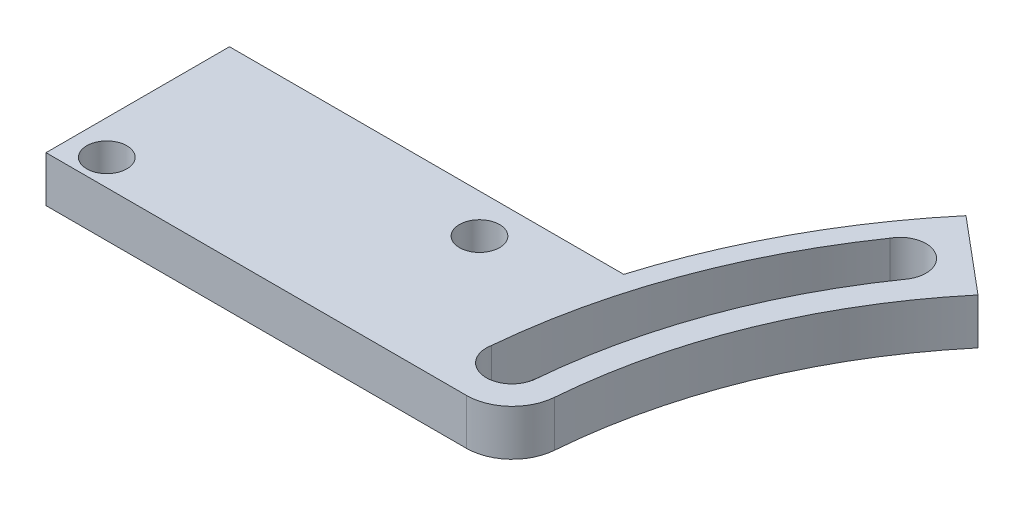
ISO-10303-21;
HEADER;
FILE_DESCRIPTION(('STEP AP214'),'2;1');
FILE_NAME('part.step','',(''),(''),'','','');
FILE_SCHEMA(('AUTOMOTIVE_DESIGN { 1 0 10303 214 1 1 1 1 }'));
ENDSEC;
DATA;
#1=APPLICATION_CONTEXT('core data for automotive mechanical design processes');
#2=APPLICATION_PROTOCOL_DEFINITION('international standard','automotive_design',2000,#1);
#3=PRODUCT_CONTEXT('',#1,'mechanical');
#4=PRODUCT('Part','Part','',(#3));
#5=PRODUCT_RELATED_PRODUCT_CATEGORY('part','',(#4));
#6=PRODUCT_DEFINITION_FORMATION('','',#4);
#7=PRODUCT_DEFINITION_CONTEXT('part definition',#1,'design');
#8=PRODUCT_DEFINITION('design','',#6,#7);
#9=PRODUCT_DEFINITION_SHAPE('','',#8);
#10=(LENGTH_UNIT() NAMED_UNIT(*) SI_UNIT(.MILLI.,.METRE.));
#11=(NAMED_UNIT(*) PLANE_ANGLE_UNIT() SI_UNIT($,.RADIAN.));
#12=(NAMED_UNIT(*) SI_UNIT($,.STERADIAN.) SOLID_ANGLE_UNIT());
#13=UNCERTAINTY_MEASURE_WITH_UNIT(LENGTH_MEASURE(1.E-05),#10,'distance_accuracy_value','');
#14=(GEOMETRIC_REPRESENTATION_CONTEXT(3) GLOBAL_UNCERTAINTY_ASSIGNED_CONTEXT((#13)) GLOBAL_UNIT_ASSIGNED_CONTEXT((#10,
#11,#12)) REPRESENTATION_CONTEXT('',''));
#15=CARTESIAN_POINT('',(0.,0.,0.));
#16=DIRECTION('',(0.,0.,1.));
#17=DIRECTION('',(1.,0.,0.));
#18=AXIS2_PLACEMENT_3D('',#15,#16,#17);
#19=CARTESIAN_POINT('',(0.,4.,0.));
#20=DIRECTION('',(0.,-1.,0.));
#21=DIRECTION('',(0.,0.,-1.));
#22=AXIS2_PLACEMENT_3D('',#19,#20,#21);
#23=CYLINDRICAL_SURFACE('',#22,55.);
#24=DIRECTION('',(0.,-1.,0.));
#25=VECTOR('',#24,1.);
#26=CARTESIAN_POINT('',(-42.132444371544,4.,-35.3533185327594));
#27=LINE('',#26,#25);
#28=CARTESIAN_POINT('',(-42.132444371544,0.,-35.3533185327594));
#29=VERTEX_POINT('',#28);
#30=CARTESIAN_POINT('',(-42.132444371544,4.,-35.3533185327594));
#31=VERTEX_POINT('',#30);
#32=EDGE_CURVE('E180',#29,#31,#27,.F.);
#33=ORIENTED_EDGE('',*,*,#32,.F.);
#34=CARTESIAN_POINT('',(0.,0.,0.));
#35=DIRECTION('',(0.,1.,0.));
#36=DIRECTION('',(0.,0.,1.));
#37=AXIS2_PLACEMENT_3D('',#34,#35,#36);
#38=CIRCLE('',#37,55.);
#39=CARTESIAN_POINT('',(-52.6212884676915,0.,-16.));
#40=VERTEX_POINT('',#39);
#41=EDGE_CURVE('E221',#29,#40,#38,.T.);
#42=ORIENTED_EDGE('',*,*,#41,.T.);
#43=DIRECTION('',(0.,-1.,0.));
#44=VECTOR('',#43,1.);
#45=CARTESIAN_POINT('',(-52.6212884676915,4.,-16.));
#46=LINE('',#45,#44);
#47=CARTESIAN_POINT('',(-52.6212884676915,4.,-16.));
#48=VERTEX_POINT('',#47);
#49=EDGE_CURVE('E218',#48,#40,#46,.T.);
#50=ORIENTED_EDGE('',*,*,#49,.F.);
#51=CARTESIAN_POINT('',(0.,4.,0.));
#52=DIRECTION('',(0.,1.,0.));
#53=DIRECTION('',(0.,0.,1.));
#54=AXIS2_PLACEMENT_3D('',#51,#52,#53);
#55=CIRCLE('',#54,55.);
#56=EDGE_CURVE('E222',#31,#48,#55,.T.);
#57=ORIENTED_EDGE('',*,*,#56,.F.);
#58=EDGE_LOOP('',(#33,#42,#50,#57));
#59=FACE_BOUND('',#58,.T.);
#60=ADVANCED_FACE('F33',(#59),#23,.T.);
#61=CARTESIAN_POINT('',(0.,4.,0.));
#62=DIRECTION('',(0.,-1.,0.));
#63=DIRECTION('',(0.,0.,-1.));
#64=AXIS2_PLACEMENT_3D('',#61,#62,#63);
#65=CYLINDRICAL_SURFACE('',#64,46.5);
#66=CARTESIAN_POINT('',(0.,4.,0.));
#67=DIRECTION('',(0.,1.,0.));
#68=DIRECTION('',(0.,0.,1.));
#69=AXIS2_PLACEMENT_3D('',#66,#67,#68);
#70=CIRCLE('',#69,46.5);
#71=CARTESIAN_POINT('',(-35.6210666050327,4.,-29.8896238504239));
#72=VERTEX_POINT('',#71);
#73=CARTESIAN_POINT('',(-46.3539024371184,4.,-3.68316831683168));
#74=VERTEX_POINT('',#73);
#75=EDGE_CURVE('E193',#72,#74,#70,.T.);
#76=ORIENTED_EDGE('',*,*,#75,.T.);
#77=DIRECTION('',(0.,-1.,0.));
#78=VECTOR('',#77,1.);
#79=CARTESIAN_POINT('',(-46.3539024371184,4.,-3.68316831683168));
#80=LINE('',#79,#78);
#81=CARTESIAN_POINT('',(-46.3539024371184,0.,-3.68316831683168));
#82=VERTEX_POINT('',#81);
#83=EDGE_CURVE('E228',#74,#82,#80,.T.);
#84=ORIENTED_EDGE('',*,*,#83,.T.);
#85=CARTESIAN_POINT('',(0.,0.,0.));
#86=DIRECTION('',(0.,1.,0.));
#87=DIRECTION('',(0.,0.,1.));
#88=AXIS2_PLACEMENT_3D('',#85,#86,#87);
#89=CIRCLE('',#88,46.5);
#90=CARTESIAN_POINT('',(-35.6210666050327,0.,-29.8896238504239));
#91=VERTEX_POINT('',#90);
#92=EDGE_CURVE('E191',#91,#82,#89,.T.);
#93=ORIENTED_EDGE('',*,*,#92,.F.);
#94=DIRECTION('',(0.,-1.,0.));
#95=VECTOR('',#94,1.);
#96=CARTESIAN_POINT('',(-35.6210666050327,4.,-29.8896238504239));
#97=LINE('',#96,#95);
#98=EDGE_CURVE('E224',#91,#72,#97,.F.);
#99=ORIENTED_EDGE('',*,*,#98,.T.);
#100=EDGE_LOOP('',(#76,#84,#93,#99));
#101=FACE_BOUND('',#100,.T.);
#102=ADVANCED_FACE('F261',(#101),#65,.F.);
#103=CARTESIAN_POINT('',(0.,4.,0.));
#104=DIRECTION('',(0.,1.,0.));
#105=DIRECTION('',(0.,0.,1.));
#106=AXIS2_PLACEMENT_3D('',#103,#104,#105);
#107=PLANE('',#106);
#108=CARTESIAN_POINT('',(0.,4.,0.));
#109=DIRECTION('',(0.,1.,0.));
#110=DIRECTION('',(0.,0.,1.));
#111=AXIS2_PLACEMENT_3D('',#108,#109,#110);
#112=CIRCLE('',#111,53.2380313408694);
#113=CARTESIAN_POINT('',(-53.0142817515423,4.,-4.87584981510754));
#114=VERTEX_POINT('',#113);
#115=CARTESIAN_POINT('',(-43.7454317895567,4.,-30.3418057899762));
#116=VERTEX_POINT('',#115);
#117=EDGE_CURVE('E151',#114,#116,#112,.F.);
#118=ORIENTED_EDGE('',*,*,#117,.T.);
#119=CARTESIAN_POINT('',(-41.776754258739,4.,-29.2523982539028));
#120=DIRECTION('',(0.,1.,0.));
#121=DIRECTION('',(-0.499999999999989,0.,0.866025403784445));
#122=AXIS2_PLACEMENT_3D('',#119,#120,#121);
#123=CIRCLE('',#122,2.25);
#124=CARTESIAN_POINT('',(-39.9711449872945,4.,-27.9099098335156));
#125=VERTEX_POINT('',#124);
#126=EDGE_CURVE('E150',#125,#116,#123,.T.);
#127=ORIENTED_EDGE('',*,*,#126,.F.);
#128=DIRECTION('',(0.819904880909852,0.,0.572499769659518));
#129=VECTOR('',#128,1.);
#130=CARTESIAN_POINT('',(0.,4.,0.));
#131=LINE('',#130,#129);
#132=CARTESIAN_POINT('',(-39.9703629443553,4.,-27.9093637709015));
#133=VERTEX_POINT('',#132);
#134=EDGE_CURVE('E56',#125,#133,#131,.T.);
#135=ORIENTED_EDGE('',*,*,#134,.T.);
#136=CARTESIAN_POINT('',(0.,4.,0.));
#137=DIRECTION('',(0.,1.,0.));
#138=DIRECTION('',(0.,0.,1.));
#139=AXIS2_PLACEMENT_3D('',#136,#137,#138);
#140=CIRCLE('',#139,48.75);
#141=CARTESIAN_POINT('',(-48.5829094993656,4.,-4.0327911644982));
#142=VERTEX_POINT('',#141);
#143=EDGE_CURVE('E137',#133,#142,#140,.T.);
#144=ORIENTED_EDGE('',*,*,#143,.T.);
#145=DIRECTION('',(0.996572502551089,0.,0.08272392132304));
#146=VECTOR('',#145,1.);
#147=CARTESIAN_POINT('',(0.,4.,0.));
#148=LINE('',#147,#146);
#149=CARTESIAN_POINT('',(-48.5938316215539,4.,-4.03369779274078));
#150=VERTEX_POINT('',#149);
#151=EDGE_CURVE('E153',#150,#142,#148,.T.);
#152=ORIENTED_EDGE('',*,*,#151,.F.);
#153=CARTESIAN_POINT('',(-50.805929602679,4.,-4.44494288013057));
#154=DIRECTION('',(0.,1.,0.));
#155=DIRECTION('',(0.,0.,1.));
#156=AXIS2_PLACEMENT_3D('',#153,#154,#155);
#157=CIRCLE('',#156,2.25);
#158=EDGE_CURVE('E189',#114,#150,#157,.T.);
#159=ORIENTED_EDGE('',*,*,#158,.F.);
#160=EDGE_LOOP('',(#118,#127,#135,#144,#152,#159));
#161=FACE_BOUND('',#160,.T.);
#162=CARTESIAN_POINT('',(-84.,4.,-2.3));
#163=DIRECTION('',(0.,1.,0.));
#164=DIRECTION('',(0.,0.,1.));
#165=AXIS2_PLACEMENT_3D('',#162,#163,#164);
#166=CIRCLE('',#165,1.75);
#167=CARTESIAN_POINT('',(-84.,4.,-0.550000000000003));
#168=VERTEX_POINT('',#167);
#169=EDGE_CURVE('E166',#168,#168,#166,.T.);
#170=ORIENTED_EDGE('',*,*,#169,.F.);
#171=EDGE_LOOP('',(#170));
#172=FACE_BOUND('',#171,.T.);
#173=CARTESIAN_POINT('',(-61.8,4.,-12.6));
#174=DIRECTION('',(0.,1.,0.));
#175=DIRECTION('',(0.,0.,1.));
#176=AXIS2_PLACEMENT_3D('',#173,#174,#175);
#177=CIRCLE('',#176,1.75);
#178=CARTESIAN_POINT('',(-61.8,4.,-10.85));
#179=VERTEX_POINT('',#178);
#180=EDGE_CURVE('E165',#179,#179,#177,.T.);
#181=ORIENTED_EDGE('',*,*,#180,.F.);
#182=EDGE_LOOP('',(#181));
#183=FACE_BOUND('',#182,.T.);
#184=DIRECTION('',(1.,0.,0.));
#185=VECTOR('',#184,1.);
#186=CARTESIAN_POINT('',(-87.,4.,0.));
#187=LINE('',#186,#185);
#188=CARTESIAN_POINT('',(-87.,4.,0.));
#189=VERTEX_POINT('',#188);
#190=CARTESIAN_POINT('',(-50.3413349048275,4.,0.));
#191=VERTEX_POINT('',#190);
#192=EDGE_CURVE('E204',#189,#191,#187,.T.);
#193=ORIENTED_EDGE('',*,*,#192,.T.);
#194=CARTESIAN_POINT('',(-50.3413349048275,4.,-4.));
#195=DIRECTION('',(0.,1.,0.));
#196=DIRECTION('',(0.,0.,1.));
#197=AXIS2_PLACEMENT_3D('',#194,#195,#196);
#198=CIRCLE('',#197,4.);
#199=EDGE_CURVE('E235',#191,#74,#198,.T.);
#200=ORIENTED_EDGE('',*,*,#199,.T.);
#201=ORIENTED_EDGE('',*,*,#75,.F.);
#202=DIRECTION('',(0.766044443118982,0.,0.642787609686535));
#203=VECTOR('',#202,1.);
#204=CARTESIAN_POINT('',(-47.8029153473241,4.,-40.1114086371379));
#205=LINE('',#204,#203);
#206=EDGE_CURVE('E178',#31,#72,#205,.T.);
#207=ORIENTED_EDGE('',*,*,#206,.F.);
#208=ORIENTED_EDGE('',*,*,#56,.T.);
#209=DIRECTION('',(-1.,0.,0.));
#210=VECTOR('',#209,1.);
#211=CARTESIAN_POINT('',(-87.,4.,-16.));
#212=LINE('',#211,#210);
#213=CARTESIAN_POINT('',(-87.,4.,-16.));
#214=VERTEX_POINT('',#213);
#215=EDGE_CURVE('E199',#48,#214,#212,.T.);
#216=ORIENTED_EDGE('',*,*,#215,.T.);
#217=DIRECTION('',(0.,0.,1.));
#218=VECTOR('',#217,1.);
#219=CARTESIAN_POINT('',(-87.,4.,0.));
#220=LINE('',#219,#218);
#221=EDGE_CURVE('E201',#214,#189,#220,.T.);
#222=ORIENTED_EDGE('',*,*,#221,.T.);
#223=EDGE_LOOP('',(#193,#200,#201,#207,#208,#216,#222));
#224=FACE_BOUND('',#223,.T.);
#225=ADVANCED_FACE('F147',(#161,#172,#183,#224),#107,.T.);
#226=CARTESIAN_POINT('',(0.,0.,0.));
#227=DIRECTION('',(0.,1.,0.));
#228=DIRECTION('',(0.,0.,1.));
#229=AXIS2_PLACEMENT_3D('',#226,#227,#228);
#230=PLANE('',#229);
#231=CARTESIAN_POINT('',(-84.,0.,-2.3));
#232=DIRECTION('',(0.,1.,0.));
#233=DIRECTION('',(0.,0.,1.));
#234=AXIS2_PLACEMENT_3D('',#231,#232,#233);
#235=CIRCLE('',#234,1.75);
#236=CARTESIAN_POINT('',(-84.,0.,-0.550000000000003));
#237=VERTEX_POINT('',#236);
#238=EDGE_CURVE('E170',#237,#237,#235,.T.);
#239=ORIENTED_EDGE('',*,*,#238,.T.);
#240=EDGE_LOOP('',(#239));
#241=FACE_BOUND('',#240,.T.);
#242=CARTESIAN_POINT('',(-61.8,0.,-12.6));
#243=DIRECTION('',(0.,1.,0.));
#244=DIRECTION('',(0.,0.,1.));
#245=AXIS2_PLACEMENT_3D('',#242,#243,#244);
#246=CIRCLE('',#245,1.75);
#247=CARTESIAN_POINT('',(-61.8,0.,-10.85));
#248=VERTEX_POINT('',#247);
#249=EDGE_CURVE('E173',#248,#248,#246,.T.);
#250=ORIENTED_EDGE('',*,*,#249,.T.);
#251=EDGE_LOOP('',(#250));
#252=FACE_BOUND('',#251,.T.);
#253=ORIENTED_EDGE('',*,*,#92,.T.);
#254=CARTESIAN_POINT('',(-50.3413349048275,0.,-4.));
#255=DIRECTION('',(0.,1.,0.));
#256=DIRECTION('',(0.,0.,1.));
#257=AXIS2_PLACEMENT_3D('',#254,#255,#256);
#258=CIRCLE('',#257,4.);
#259=CARTESIAN_POINT('',(-50.3413349048275,0.,0.));
#260=VERTEX_POINT('',#259);
#261=EDGE_CURVE('E231',#82,#260,#258,.F.);
#262=ORIENTED_EDGE('',*,*,#261,.T.);
#263=DIRECTION('',(1.,0.,0.));
#264=VECTOR('',#263,1.);
#265=CARTESIAN_POINT('',(-87.,0.,0.));
#266=LINE('',#265,#264);
#267=CARTESIAN_POINT('',(-87.,0.,0.));
#268=VERTEX_POINT('',#267);
#269=EDGE_CURVE('E202',#268,#260,#266,.T.);
#270=ORIENTED_EDGE('',*,*,#269,.F.);
#271=DIRECTION('',(0.,0.,1.));
#272=VECTOR('',#271,1.);
#273=CARTESIAN_POINT('',(-87.,0.,0.));
#274=LINE('',#273,#272);
#275=CARTESIAN_POINT('',(-87.,0.,-16.));
#276=VERTEX_POINT('',#275);
#277=EDGE_CURVE('E209',#276,#268,#274,.T.);
#278=ORIENTED_EDGE('',*,*,#277,.F.);
#279=DIRECTION('',(-1.,0.,0.));
#280=VECTOR('',#279,1.);
#281=CARTESIAN_POINT('',(-87.,0.,-16.));
#282=LINE('',#281,#280);
#283=EDGE_CURVE('E196',#40,#276,#282,.T.);
#284=ORIENTED_EDGE('',*,*,#283,.F.);
#285=ORIENTED_EDGE('',*,*,#41,.F.);
#286=DIRECTION('',(0.766044443118982,0.,0.642787609686535));
#287=VECTOR('',#286,1.);
#288=CARTESIAN_POINT('',(-47.8029153473241,0.,-40.1114086371379));
#289=LINE('',#288,#287);
#290=EDGE_CURVE('E169',#29,#91,#289,.T.);
#291=ORIENTED_EDGE('',*,*,#290,.T.);
#292=EDGE_LOOP('',(#253,#262,#270,#278,#284,#285,#291));
#293=FACE_BOUND('',#292,.T.);
#294=CARTESIAN_POINT('',(-41.776754258739,0.,-29.2523982539028));
#295=DIRECTION('',(0.,1.,0.));
#296=DIRECTION('',(-0.499999999999989,0.,0.866025403784445));
#297=AXIS2_PLACEMENT_3D('',#294,#295,#296);
#298=CIRCLE('',#297,2.25);
#299=CARTESIAN_POINT('',(-39.9711449872945,0.,-27.9099098335156));
#300=VERTEX_POINT('',#299);
#301=CARTESIAN_POINT('',(-43.7454317895567,0.,-30.3418057899762));
#302=VERTEX_POINT('',#301);
#303=EDGE_CURVE('E184',#300,#302,#298,.T.);
#304=ORIENTED_EDGE('',*,*,#303,.T.);
#305=CARTESIAN_POINT('',(0.,0.,0.));
#306=DIRECTION('',(0.,1.,0.));
#307=DIRECTION('',(0.,0.,1.));
#308=AXIS2_PLACEMENT_3D('',#305,#306,#307);
#309=CIRCLE('',#308,53.2380313408694);
#310=CARTESIAN_POINT('',(-53.0142817515423,0.,-4.87584981510754));
#311=VERTEX_POINT('',#310);
#312=EDGE_CURVE('E48',#311,#302,#309,.F.);
#313=ORIENTED_EDGE('',*,*,#312,.F.);
#314=CARTESIAN_POINT('',(-50.805929602679,0.,-4.44494288013057));
#315=DIRECTION('',(0.,1.,0.));
#316=DIRECTION('',(0.,0.,1.));
#317=AXIS2_PLACEMENT_3D('',#314,#315,#316);
#318=CIRCLE('',#317,2.25);
#319=CARTESIAN_POINT('',(-48.5938316215539,0.,-4.03369779274078));
#320=VERTEX_POINT('',#319);
#321=EDGE_CURVE('E186',#311,#320,#318,.T.);
#322=ORIENTED_EDGE('',*,*,#321,.T.);
#323=DIRECTION('',(0.996572502551089,0.,0.08272392132304));
#324=VECTOR('',#323,1.);
#325=CARTESIAN_POINT('',(0.,0.,0.));
#326=LINE('',#325,#324);
#327=CARTESIAN_POINT('',(-48.5829094993656,0.,-4.0327911644982));
#328=VERTEX_POINT('',#327);
#329=EDGE_CURVE('E143',#320,#328,#326,.T.);
#330=ORIENTED_EDGE('',*,*,#329,.T.);
#331=CARTESIAN_POINT('',(0.,0.,0.));
#332=DIRECTION('',(0.,1.,0.));
#333=DIRECTION('',(0.,0.,1.));
#334=AXIS2_PLACEMENT_3D('',#331,#332,#333);
#335=CIRCLE('',#334,48.75);
#336=CARTESIAN_POINT('',(-39.9703629443553,0.,-27.9093637709015));
#337=VERTEX_POINT('',#336);
#338=EDGE_CURVE('E157',#337,#328,#335,.T.);
#339=ORIENTED_EDGE('',*,*,#338,.F.);
#340=DIRECTION('',(0.819904880909852,0.,0.572499769659518));
#341=VECTOR('',#340,1.);
#342=CARTESIAN_POINT('',(0.,0.,0.));
#343=LINE('',#342,#341);
#344=EDGE_CURVE('E131',#300,#337,#343,.T.);
#345=ORIENTED_EDGE('',*,*,#344,.F.);
#346=EDGE_LOOP('',(#304,#313,#322,#330,#339,#345));
#347=FACE_BOUND('',#346,.T.);
#348=ADVANCED_FACE('F241',(#241,#252,#293,#347),#230,.F.);
#349=CARTESIAN_POINT('',(-87.,4.,-16.));
#350=DIRECTION('',(0.,0.,1.));
#351=DIRECTION('',(1.,0.,0.));
#352=AXIS2_PLACEMENT_3D('',#349,#350,#351);
#353=PLANE('',#352);
#354=ORIENTED_EDGE('',*,*,#215,.F.);
#355=ORIENTED_EDGE('',*,*,#49,.T.);
#356=ORIENTED_EDGE('',*,*,#283,.T.);
#357=DIRECTION('',(0.,-1.,0.));
#358=VECTOR('',#357,1.);
#359=CARTESIAN_POINT('',(-87.,4.,-16.));
#360=LINE('',#359,#358);
#361=EDGE_CURVE('E215',#214,#276,#360,.T.);
#362=ORIENTED_EDGE('',*,*,#361,.F.);
#363=EDGE_LOOP('',(#354,#355,#356,#362));
#364=FACE_BOUND('',#363,.T.);
#365=ADVANCED_FACE('F272',(#364),#353,.F.);
#366=CARTESIAN_POINT('',(-87.,4.,0.));
#367=DIRECTION('',(0.,0.,-1.));
#368=DIRECTION('',(-1.,0.,0.));
#369=AXIS2_PLACEMENT_3D('',#366,#367,#368);
#370=PLANE('',#369);
#371=ORIENTED_EDGE('',*,*,#269,.T.);
#372=DIRECTION('',(0.,1.,0.));
#373=VECTOR('',#372,1.);
#374=CARTESIAN_POINT('',(-50.3413349048275,4.,0.));
#375=LINE('',#374,#373);
#376=EDGE_CURVE('E233',#260,#191,#375,.T.);
#377=ORIENTED_EDGE('',*,*,#376,.T.);
#378=ORIENTED_EDGE('',*,*,#192,.F.);
#379=DIRECTION('',(0.,-1.,0.));
#380=VECTOR('',#379,1.);
#381=CARTESIAN_POINT('',(-87.,4.,0.));
#382=LINE('',#381,#380);
#383=EDGE_CURVE('E207',#189,#268,#382,.T.);
#384=ORIENTED_EDGE('',*,*,#383,.T.);
#385=EDGE_LOOP('',(#371,#377,#378,#384));
#386=FACE_BOUND('',#385,.T.);
#387=ADVANCED_FACE('F278',(#386),#370,.F.);
#388=CARTESIAN_POINT('',(-87.,4.,0.));
#389=DIRECTION('',(1.,0.,0.));
#390=DIRECTION('',(0.,0.,-1.));
#391=AXIS2_PLACEMENT_3D('',#388,#389,#390);
#392=PLANE('',#391);
#393=ORIENTED_EDGE('',*,*,#277,.T.);
#394=ORIENTED_EDGE('',*,*,#383,.F.);
#395=ORIENTED_EDGE('',*,*,#221,.F.);
#396=ORIENTED_EDGE('',*,*,#361,.T.);
#397=EDGE_LOOP('',(#393,#394,#395,#396));
#398=FACE_BOUND('',#397,.T.);
#399=ADVANCED_FACE('F280',(#398),#392,.F.);
#400=CARTESIAN_POINT('',(-50.805929602679,4.,-4.44494288013057));
#401=DIRECTION('',(0.,-1.,0.));
#402=DIRECTION('',(0.,0.,-1.));
#403=AXIS2_PLACEMENT_3D('',#400,#401,#402);
#404=CYLINDRICAL_SURFACE('',#403,2.25);
#405=DIRECTION('',(0.,-1.,0.));
#406=VECTOR('',#405,1.);
#407=CARTESIAN_POINT('',(-53.0142817515423,2.,-4.87584981510737));
#408=LINE('',#407,#406);
#409=EDGE_CURVE('E133',#114,#311,#408,.T.);
#410=ORIENTED_EDGE('',*,*,#409,.F.);
#411=ORIENTED_EDGE('',*,*,#158,.T.);
#412=DIRECTION('',(0.,-1.,0.));
#413=VECTOR('',#412,1.);
#414=CARTESIAN_POINT('',(-48.5938316215539,4.,-4.03369779274078));
#415=LINE('',#414,#413);
#416=EDGE_CURVE('E11',#150,#320,#415,.T.);
#417=ORIENTED_EDGE('',*,*,#416,.T.);
#418=ORIENTED_EDGE('',*,*,#321,.F.);
#419=EDGE_LOOP('',(#410,#411,#417,#418));
#420=FACE_BOUND('',#419,.T.);
#421=ADVANCED_FACE('F248',(#420),#404,.F.);
#422=CARTESIAN_POINT('',(-41.776754258739,4.,-29.2523982539028));
#423=DIRECTION('',(0.,-1.,0.));
#424=DIRECTION('',(0.,0.,-1.));
#425=AXIS2_PLACEMENT_3D('',#422,#423,#424);
#426=CYLINDRICAL_SURFACE('',#425,2.25);
#427=DIRECTION('',(0.,-1.,0.));
#428=VECTOR('',#427,1.);
#429=CARTESIAN_POINT('',(-39.9711449872945,4.,-27.9099098335156));
#430=LINE('',#429,#428);
#431=EDGE_CURVE('E41',#125,#300,#430,.T.);
#432=ORIENTED_EDGE('',*,*,#431,.F.);
#433=ORIENTED_EDGE('',*,*,#126,.T.);
#434=DIRECTION('',(0.,-1.,0.));
#435=VECTOR('',#434,1.);
#436=CARTESIAN_POINT('',(-43.7454317895566,2.,-30.3418057899764));
#437=LINE('',#436,#435);
#438=EDGE_CURVE('E237',#302,#116,#437,.F.);
#439=ORIENTED_EDGE('',*,*,#438,.F.);
#440=ORIENTED_EDGE('',*,*,#303,.F.);
#441=EDGE_LOOP('',(#432,#433,#439,#440));
#442=FACE_BOUND('',#441,.T.);
#443=ADVANCED_FACE('F242',(#442),#426,.F.);
#444=CARTESIAN_POINT('',(-47.8029153473241,4.,-40.1114086371379));
#445=DIRECTION('',(0.642787609686535,0.,-0.766044443118982));
#446=DIRECTION('',(-0.766044443118982,0.,-0.642787609686535));
#447=AXIS2_PLACEMENT_3D('',#444,#445,#446);
#448=PLANE('',#447);
#449=ORIENTED_EDGE('',*,*,#32,.T.);
#450=ORIENTED_EDGE('',*,*,#206,.T.);
#451=ORIENTED_EDGE('',*,*,#98,.F.);
#452=ORIENTED_EDGE('',*,*,#290,.F.);
#453=EDGE_LOOP('',(#449,#450,#451,#452));
#454=FACE_BOUND('',#453,.T.);
#455=ADVANCED_FACE('F291',(#454),#448,.T.);
#456=CARTESIAN_POINT('',(-61.8,4.,-12.6));
#457=DIRECTION('',(0.,-1.,0.));
#458=DIRECTION('',(0.,0.,-1.));
#459=AXIS2_PLACEMENT_3D('',#456,#457,#458);
#460=CYLINDRICAL_SURFACE('',#459,1.75);
#461=ORIENTED_EDGE('',*,*,#180,.T.);
#462=EDGE_LOOP('',(#461));
#463=FACE_BOUND('',#462,.T.);
#464=ORIENTED_EDGE('',*,*,#249,.F.);
#465=EDGE_LOOP('',(#464));
#466=FACE_BOUND('',#465,.T.);
#467=ADVANCED_FACE('F294',(#463,#466),#460,.F.);
#468=CARTESIAN_POINT('',(-84.,4.,-2.3));
#469=DIRECTION('',(0.,-1.,0.));
#470=DIRECTION('',(0.,0.,-1.));
#471=AXIS2_PLACEMENT_3D('',#468,#469,#470);
#472=CYLINDRICAL_SURFACE('',#471,1.75);
#473=ORIENTED_EDGE('',*,*,#169,.T.);
#474=EDGE_LOOP('',(#473));
#475=FACE_BOUND('',#474,.T.);
#476=ORIENTED_EDGE('',*,*,#238,.F.);
#477=EDGE_LOOP('',(#476));
#478=FACE_BOUND('',#477,.T.);
#479=ADVANCED_FACE('F298',(#475,#478),#472,.F.);
#480=CARTESIAN_POINT('',(-50.3413349048275,4.,-4.));
#481=DIRECTION('',(0.,-1.,0.));
#482=DIRECTION('',(0.,0.,-1.));
#483=AXIS2_PLACEMENT_3D('',#480,#481,#482);
#484=CYLINDRICAL_SURFACE('',#483,4.);
#485=ORIENTED_EDGE('',*,*,#199,.F.);
#486=ORIENTED_EDGE('',*,*,#376,.F.);
#487=ORIENTED_EDGE('',*,*,#261,.F.);
#488=ORIENTED_EDGE('',*,*,#83,.F.);
#489=EDGE_LOOP('',(#485,#486,#487,#488));
#490=FACE_BOUND('',#489,.T.);
#491=ADVANCED_FACE('F35',(#490),#484,.T.);
#492=CARTESIAN_POINT('',(0.,4.,0.));
#493=DIRECTION('',(0.,-1.,0.));
#494=DIRECTION('',(0.,0.,-1.));
#495=AXIS2_PLACEMENT_3D('',#492,#493,#494);
#496=CYLINDRICAL_SURFACE('',#495,53.2380313408694);
#497=ORIENTED_EDGE('',*,*,#409,.T.);
#498=ORIENTED_EDGE('',*,*,#312,.T.);
#499=ORIENTED_EDGE('',*,*,#438,.T.);
#500=ORIENTED_EDGE('',*,*,#117,.F.);
#501=EDGE_LOOP('',(#497,#498,#499,#500));
#502=FACE_BOUND('',#501,.T.);
#503=ADVANCED_FACE('F243',(#502),#496,.F.);
#504=CARTESIAN_POINT('',(0.,4.,0.));
#505=DIRECTION('',(0.,-1.,0.));
#506=DIRECTION('',(0.,0.,-1.));
#507=AXIS2_PLACEMENT_3D('',#504,#505,#506);
#508=CYLINDRICAL_SURFACE('',#507,48.75);
#509=ORIENTED_EDGE('',*,*,#143,.F.);
#510=DIRECTION('',(0.,-1.,0.));
#511=VECTOR('',#510,1.);
#512=CARTESIAN_POINT('',(-39.9703629443553,4.,-27.9093637709015));
#513=LINE('',#512,#511);
#514=EDGE_CURVE('E127',#133,#337,#513,.T.);
#515=ORIENTED_EDGE('',*,*,#514,.T.);
#516=ORIENTED_EDGE('',*,*,#338,.T.);
#517=DIRECTION('',(0.,-1.,0.));
#518=VECTOR('',#517,1.);
#519=CARTESIAN_POINT('',(-48.5829094993656,4.,-4.0327911644982));
#520=LINE('',#519,#518);
#521=EDGE_CURVE('E134',#142,#328,#520,.T.);
#522=ORIENTED_EDGE('',*,*,#521,.F.);
#523=EDGE_LOOP('',(#509,#515,#516,#522));
#524=FACE_BOUND('',#523,.T.);
#525=ADVANCED_FACE('F138',(#524),#508,.T.);
#526=CARTESIAN_POINT('',(0.,4.,0.));
#527=DIRECTION('',(0.572499769659518,0.,-0.819904880909852));
#528=DIRECTION('',(-0.819904880909852,0.,-0.572499769659518));
#529=AXIS2_PLACEMENT_3D('',#526,#527,#528);
#530=PLANE('',#529);
#531=ORIENTED_EDGE('',*,*,#431,.T.);
#532=ORIENTED_EDGE('',*,*,#344,.T.);
#533=ORIENTED_EDGE('',*,*,#514,.F.);
#534=ORIENTED_EDGE('',*,*,#134,.F.);
#535=EDGE_LOOP('',(#531,#532,#533,#534));
#536=FACE_BOUND('',#535,.T.);
#537=ADVANCED_FACE('F129',(#536),#530,.F.);
#538=CARTESIAN_POINT('',(0.,4.,0.));
#539=DIRECTION('',(0.08272392132304,0.,-0.996572502551089));
#540=DIRECTION('',(-0.996572502551089,0.,-0.08272392132304));
#541=AXIS2_PLACEMENT_3D('',#538,#539,#540);
#542=PLANE('',#541);
#543=ORIENTED_EDGE('',*,*,#151,.T.);
#544=ORIENTED_EDGE('',*,*,#521,.T.);
#545=ORIENTED_EDGE('',*,*,#329,.F.);
#546=ORIENTED_EDGE('',*,*,#416,.F.);
#547=EDGE_LOOP('',(#543,#544,#545,#546));
#548=FACE_BOUND('',#547,.T.);
#549=ADVANCED_FACE('F252',(#548),#542,.T.);
#550=CLOSED_SHELL('',(#60,#102,#225,#348,#365,#387,#399,#421,#443,#455,#467,#479,#491,#503,#525,
#537,#549));
#551=MANIFOLD_SOLID_BREP('B2',#550);
#552=ADVANCED_BREP_SHAPE_REPRESENTATION('',(#18,#551),#14);
#553=SHAPE_DEFINITION_REPRESENTATION(#9,#552);
ENDSEC;
END-ISO-10303-21;
